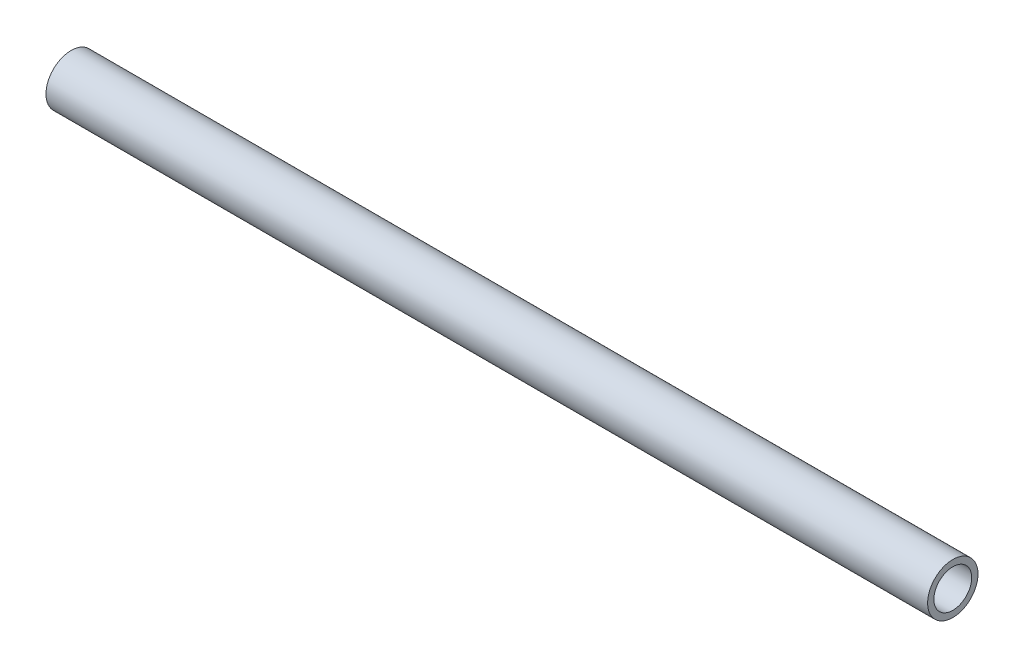
ISO-10303-21;
HEADER;
FILE_DESCRIPTION(('STEP AP214'),'2;1');
FILE_NAME('part.step','',(''),(''),'','','');
FILE_SCHEMA(('AUTOMOTIVE_DESIGN { 1 0 10303 214 1 1 1 1 }'));
ENDSEC;
DATA;
#1=APPLICATION_CONTEXT('core data for automotive mechanical design processes');
#2=APPLICATION_PROTOCOL_DEFINITION('international standard','automotive_design',2000,#1);
#3=PRODUCT_CONTEXT('',#1,'mechanical');
#4=PRODUCT('Part','Part','',(#3));
#5=PRODUCT_RELATED_PRODUCT_CATEGORY('part','',(#4));
#6=PRODUCT_DEFINITION_FORMATION('','',#4);
#7=PRODUCT_DEFINITION_CONTEXT('part definition',#1,'design');
#8=PRODUCT_DEFINITION('design','',#6,#7);
#9=PRODUCT_DEFINITION_SHAPE('','',#8);
#10=(LENGTH_UNIT() NAMED_UNIT(*) SI_UNIT(.MILLI.,.METRE.));
#11=(NAMED_UNIT(*) PLANE_ANGLE_UNIT() SI_UNIT($,.RADIAN.));
#12=(NAMED_UNIT(*) SI_UNIT($,.STERADIAN.) SOLID_ANGLE_UNIT());
#13=UNCERTAINTY_MEASURE_WITH_UNIT(LENGTH_MEASURE(1.E-05),#10,'distance_accuracy_value','');
#14=(GEOMETRIC_REPRESENTATION_CONTEXT(3) GLOBAL_UNCERTAINTY_ASSIGNED_CONTEXT((#13)) GLOBAL_UNIT_ASSIGNED_CONTEXT((#10,
#11,#12)) REPRESENTATION_CONTEXT('',''));
#15=CARTESIAN_POINT('',(0.,0.,0.));
#16=DIRECTION('',(0.,0.,1.));
#17=DIRECTION('',(1.,0.,0.));
#18=AXIS2_PLACEMENT_3D('',#15,#16,#17);
#19=CARTESIAN_POINT('',(140.,0.,0.));
#20=DIRECTION('',(1.,0.,0.));
#21=DIRECTION('',(0.,0.,-1.));
#22=AXIS2_PLACEMENT_3D('',#19,#20,#21);
#23=PLANE('',#22);
#24=CARTESIAN_POINT('',(140.,0.,0.));
#25=DIRECTION('',(1.,0.,0.));
#26=DIRECTION('',(0.,0.,-1.));
#27=AXIS2_PLACEMENT_3D('',#24,#25,#26);
#28=CIRCLE('',#27,8.);
#29=CARTESIAN_POINT('',(140.,0.,-8.));
#30=VERTEX_POINT('',#29);
#31=EDGE_CURVE('E10',#30,#30,#28,.T.);
#32=ORIENTED_EDGE('',*,*,#31,.T.);
#33=EDGE_LOOP('',(#32));
#34=FACE_BOUND('',#33,.T.);
#35=CARTESIAN_POINT('',(140.,0.,0.));
#36=DIRECTION('',(1.,0.,0.));
#37=DIRECTION('',(0.,0.,-1.));
#38=AXIS2_PLACEMENT_3D('',#35,#36,#37);
#39=CIRCLE('',#38,6.);
#40=CARTESIAN_POINT('',(140.,0.,-6.));
#41=VERTEX_POINT('',#40);
#42=EDGE_CURVE('E50',#41,#41,#39,.T.);
#43=ORIENTED_EDGE('',*,*,#42,.F.);
#44=EDGE_LOOP('',(#43));
#45=FACE_BOUND('',#44,.T.);
#46=ADVANCED_FACE('F37',(#34,#45),#23,.T.);
#47=CARTESIAN_POINT('',(-140.,0.,0.));
#48=DIRECTION('',(1.,0.,0.));
#49=DIRECTION('',(0.,0.,-1.));
#50=AXIS2_PLACEMENT_3D('',#47,#48,#49);
#51=PLANE('',#50);
#52=CARTESIAN_POINT('',(-140.,0.,0.));
#53=DIRECTION('',(1.,0.,0.));
#54=DIRECTION('',(0.,0.,-1.));
#55=AXIS2_PLACEMENT_3D('',#52,#53,#54);
#56=CIRCLE('',#55,8.);
#57=CARTESIAN_POINT('',(-140.,0.,-8.));
#58=VERTEX_POINT('',#57);
#59=EDGE_CURVE('E41',#58,#58,#56,.T.);
#60=ORIENTED_EDGE('',*,*,#59,.F.);
#61=EDGE_LOOP('',(#60));
#62=FACE_BOUND('',#61,.T.);
#63=CARTESIAN_POINT('',(-140.,0.,0.));
#64=DIRECTION('',(1.,0.,0.));
#65=DIRECTION('',(0.,0.,-1.));
#66=AXIS2_PLACEMENT_3D('',#63,#64,#65);
#67=CIRCLE('',#66,6.);
#68=CARTESIAN_POINT('',(-140.,0.,-6.));
#69=VERTEX_POINT('',#68);
#70=EDGE_CURVE('E52',#69,#69,#67,.T.);
#71=ORIENTED_EDGE('',*,*,#70,.T.);
#72=EDGE_LOOP('',(#71));
#73=FACE_BOUND('',#72,.T.);
#74=ADVANCED_FACE('F64',(#62,#73),#51,.F.);
#75=CARTESIAN_POINT('',(140.,0.,0.));
#76=DIRECTION('',(-1.,0.,0.));
#77=DIRECTION('',(0.,0.,1.));
#78=AXIS2_PLACEMENT_3D('',#75,#76,#77);
#79=CYLINDRICAL_SURFACE('',#78,8.);
#80=ORIENTED_EDGE('',*,*,#31,.F.);
#81=EDGE_LOOP('',(#80));
#82=FACE_BOUND('',#81,.T.);
#83=ORIENTED_EDGE('',*,*,#59,.T.);
#84=EDGE_LOOP('',(#83));
#85=FACE_BOUND('',#84,.T.);
#86=ADVANCED_FACE('F39',(#82,#85),#79,.T.);
#87=CARTESIAN_POINT('',(140.,0.,0.));
#88=DIRECTION('',(-1.,0.,0.));
#89=DIRECTION('',(0.,0.,1.));
#90=AXIS2_PLACEMENT_3D('',#87,#88,#89);
#91=CYLINDRICAL_SURFACE('',#90,6.);
#92=ORIENTED_EDGE('',*,*,#42,.T.);
#93=EDGE_LOOP('',(#92));
#94=FACE_BOUND('',#93,.T.);
#95=ORIENTED_EDGE('',*,*,#70,.F.);
#96=EDGE_LOOP('',(#95));
#97=FACE_BOUND('',#96,.T.);
#98=ADVANCED_FACE('F60',(#94,#97),#91,.F.);
#99=CLOSED_SHELL('',(#46,#74,#86,#98));
#100=MANIFOLD_SOLID_BREP('B2',#99);
#101=ADVANCED_BREP_SHAPE_REPRESENTATION('',(#18,#100),#14);
#102=SHAPE_DEFINITION_REPRESENTATION(#9,#101);
ENDSEC;
END-ISO-10303-21;
